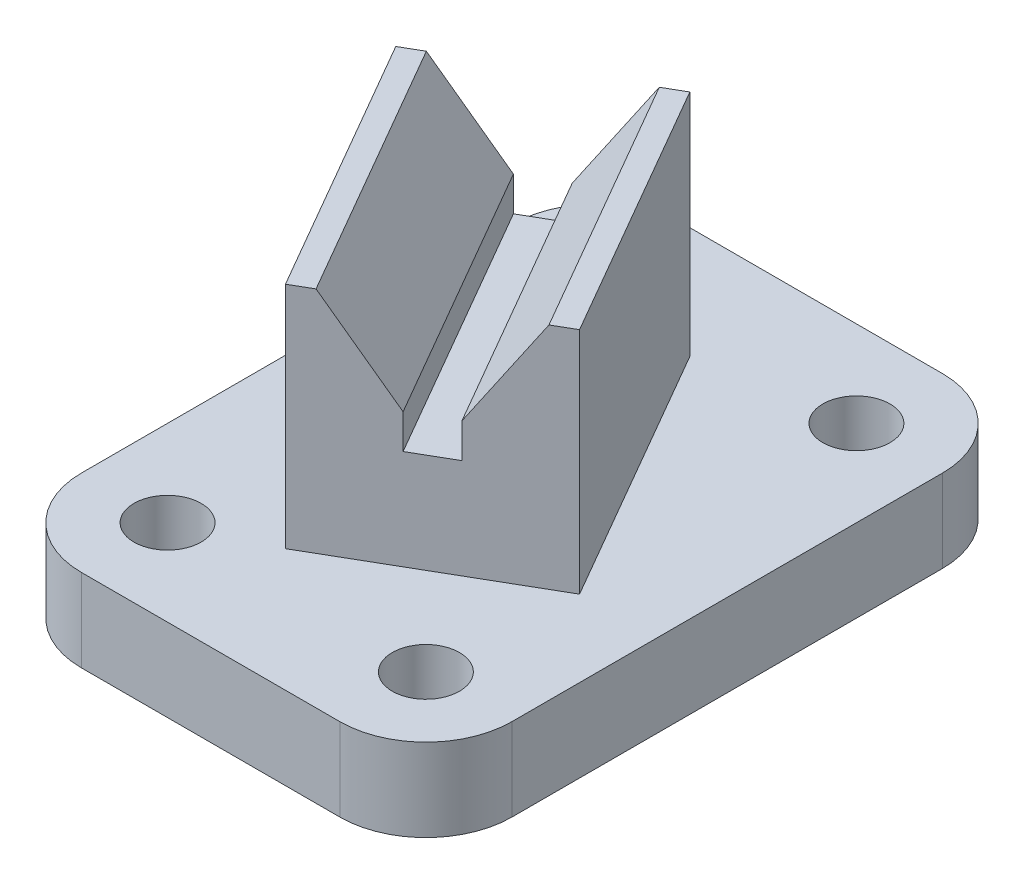
ISO-10303-21;
HEADER;
FILE_DESCRIPTION(('STEP AP214'),'2;1');
FILE_NAME('part.step','',(''),(''),'','','');
FILE_SCHEMA(('AUTOMOTIVE_DESIGN { 1 0 10303 214 1 1 1 1 }'));
ENDSEC;
DATA;
#1=APPLICATION_CONTEXT('core data for automotive mechanical design processes');
#2=APPLICATION_PROTOCOL_DEFINITION('international standard','automotive_design',2000,#1);
#3=PRODUCT_CONTEXT('',#1,'mechanical');
#4=PRODUCT('Part','Part','',(#3));
#5=PRODUCT_RELATED_PRODUCT_CATEGORY('part','',(#4));
#6=PRODUCT_DEFINITION_FORMATION('','',#4);
#7=PRODUCT_DEFINITION_CONTEXT('part definition',#1,'design');
#8=PRODUCT_DEFINITION('design','',#6,#7);
#9=PRODUCT_DEFINITION_SHAPE('','',#8);
#10=(LENGTH_UNIT() NAMED_UNIT(*) SI_UNIT(.MILLI.,.METRE.));
#11=(NAMED_UNIT(*) PLANE_ANGLE_UNIT() SI_UNIT($,.RADIAN.));
#12=(NAMED_UNIT(*) SI_UNIT($,.STERADIAN.) SOLID_ANGLE_UNIT());
#13=UNCERTAINTY_MEASURE_WITH_UNIT(LENGTH_MEASURE(1.E-05),#10,'distance_accuracy_value','');
#14=(GEOMETRIC_REPRESENTATION_CONTEXT(3) GLOBAL_UNCERTAINTY_ASSIGNED_CONTEXT((#13)) GLOBAL_UNIT_ASSIGNED_CONTEXT((#10,
#11,#12)) REPRESENTATION_CONTEXT('',''));
#15=CARTESIAN_POINT('',(0.,0.,0.));
#16=DIRECTION('',(0.,0.,1.));
#17=DIRECTION('',(1.,0.,0.));
#18=AXIS2_PLACEMENT_3D('',#15,#16,#17);
#19=CARTESIAN_POINT('',(0.313335950369593,33.782,-25.3250771291599));
#20=DIRECTION('',(0.5,0.,0.866025403784439));
#21=DIRECTION('',(0.866025403784439,0.,-0.5));
#22=AXIS2_PLACEMENT_3D('',#19,#20,#21);
#23=PLANE('',#22);
#24=DIRECTION('',(-0.483395195346347,0.829722110200009,0.279088346158185));
#25=VECTOR('',#24,1.);
#26=CARTESIAN_POINT('',(-16.6475173331422,20.6068338643605,-15.5327239202386));
#27=LINE('',#26,#25);
#28=CARTESIAN_POINT('',(-16.184447991724,19.812,-15.8000771291599));
#29=VERTEX_POINT('',#28);
#30=CARTESIAN_POINT('',(-24.3233547364901,33.782,-11.1010771291599));
#31=VERTEX_POINT('',#30);
#32=EDGE_CURVE('E160',#29,#31,#27,.T.);
#33=ORIENTED_EDGE('',*,*,#32,.F.);
#34=DIRECTION('',(0.,1.,0.));
#35=VECTOR('',#34,1.);
#36=CARTESIAN_POINT('',(-16.184447991724,33.782,-15.8000771291599));
#37=LINE('',#36,#35);
#38=CARTESIAN_POINT('',(-16.184447991724,14.732,-15.8000771291599));
#39=VERTEX_POINT('',#38);
#40=EDGE_CURVE('E384',#39,#29,#37,.T.);
#41=ORIENTED_EDGE('',*,*,#40,.F.);
#42=DIRECTION('',(-0.866025403784439,0.,0.5));
#43=VECTOR('',#42,1.);
#44=CARTESIAN_POINT('',(0.313335950369593,14.732,-25.3250771291599));
#45=LINE('',#44,#43);
#46=CARTESIAN_POINT('',(-10.6851866776928,14.732,-18.9750771291599));
#47=VERTEX_POINT('',#46);
#48=EDGE_CURVE('E386',#47,#39,#45,.T.);
#49=ORIENTED_EDGE('',*,*,#48,.F.);
#50=DIRECTION('',(0.,-1.,0.));
#51=VECTOR('',#50,1.);
#52=CARTESIAN_POINT('',(-10.6851866776928,33.782,-18.9750771291599));
#53=LINE('',#52,#51);
#54=CARTESIAN_POINT('',(-10.6851866776928,19.812,-18.9750771291599));
#55=VERTEX_POINT('',#54);
#56=EDGE_CURVE('E370',#55,#47,#53,.T.);
#57=ORIENTED_EDGE('',*,*,#56,.F.);
#58=DIRECTION('',(-0.483395195346347,-0.829722110200009,0.279088346158185));
#59=VECTOR('',#58,1.);
#60=CARTESIAN_POINT('',(-1.65533452003802,35.3112603550296,-24.1884647031244));
#61=LINE('',#60,#59);
#62=CARTESIAN_POINT('',(-2.54627993292662,33.782,-23.6740771291599));
#63=VERTEX_POINT('',#62);
#64=EDGE_CURVE('E173',#63,#55,#61,.T.);
#65=ORIENTED_EDGE('',*,*,#64,.F.);
#66=DIRECTION('',(-0.866025403784439,0.,0.5));
#67=VECTOR('',#66,1.);
#68=CARTESIAN_POINT('',(0.313335950369593,33.782,-25.3250771291599));
#69=LINE('',#68,#67);
#70=CARTESIAN_POINT('',(0.313335950369593,33.782,-25.3250771291599));
#71=VERTEX_POINT('',#70);
#72=EDGE_CURVE('E368',#71,#63,#69,.T.);
#73=ORIENTED_EDGE('',*,*,#72,.F.);
#74=DIRECTION('',(0.,-1.,0.));
#75=VECTOR('',#74,1.);
#76=CARTESIAN_POINT('',(0.313335950369593,33.782,-25.3250771291599));
#77=LINE('',#76,#75);
#78=CARTESIAN_POINT('',(0.313335950369593,0.,-25.3250771291599));
#79=VERTEX_POINT('',#78);
#80=EDGE_CURVE('E182',#71,#79,#77,.T.);
#81=ORIENTED_EDGE('',*,*,#80,.T.);
#82=DIRECTION('',(-0.866025403784439,0.,0.5));
#83=VECTOR('',#82,1.);
#84=CARTESIAN_POINT('',(0.313335950369593,0.,-25.3250771291599));
#85=LINE('',#84,#83);
#86=CARTESIAN_POINT('',(-27.1829706197863,0.,-9.45007712915988));
#87=VERTEX_POINT('',#86);
#88=EDGE_CURVE('E381',#79,#87,#85,.T.);
#89=ORIENTED_EDGE('',*,*,#88,.T.);
#90=DIRECTION('',(0.,-1.,0.));
#91=VECTOR('',#90,1.);
#92=CARTESIAN_POINT('',(-27.1829706197863,33.782,-9.45007712915988));
#93=LINE('',#92,#91);
#94=CARTESIAN_POINT('',(-27.1829706197863,33.782,-9.45007712915988));
#95=VERTEX_POINT('',#94);
#96=EDGE_CURVE('E192',#95,#87,#93,.T.);
#97=ORIENTED_EDGE('',*,*,#96,.F.);
#98=EDGE_CURVE('E373',#31,#95,#69,.T.);
#99=ORIENTED_EDGE('',*,*,#98,.F.);
#100=EDGE_LOOP('',(#33,#41,#49,#57,#65,#73,#81,#89,#97,#99));
#101=FACE_BOUND('',#100,.T.);
#102=ADVANCED_FACE('F27',(#101),#23,.F.);
#103=CARTESIAN_POINT('',(22.5383359503696,33.782,13.1697520690584));
#104=DIRECTION('',(-0.5,0.,-0.866025403784439));
#105=DIRECTION('',(-0.866025403784439,0.,0.5));
#106=AXIS2_PLACEMENT_3D('',#103,#104,#105);
#107=PLANE('',#106);
#108=DIRECTION('',(0.483395195346347,-0.829722110200009,-0.279088346158185));
#109=VECTOR('',#108,1.);
#110=CARTESIAN_POINT('',(-2.09835473649011,33.782,27.3937520690584));
#111=LINE('',#110,#109);
#112=CARTESIAN_POINT('',(-2.09835473649011,33.782,27.3937520690584));
#113=VERTEX_POINT('',#112);
#114=CARTESIAN_POINT('',(6.04055200827605,19.812,22.6947520690584));
#115=VERTEX_POINT('',#114);
#116=EDGE_CURVE('E157',#113,#115,#111,.T.);
#117=ORIENTED_EDGE('',*,*,#116,.F.);
#118=DIRECTION('',(0.866025403784439,0.,-0.5));
#119=VECTOR('',#118,1.);
#120=CARTESIAN_POINT('',(22.5383359503696,33.782,13.1697520690584));
#121=LINE('',#120,#119);
#122=CARTESIAN_POINT('',(-4.95797061978632,33.782,29.0447520690584));
#123=VERTEX_POINT('',#122);
#124=EDGE_CURVE('E170',#123,#113,#121,.T.);
#125=ORIENTED_EDGE('',*,*,#124,.F.);
#126=DIRECTION('',(0.,-1.,0.));
#127=VECTOR('',#126,1.);
#128=CARTESIAN_POINT('',(-4.95797061978632,33.782,29.0447520690584));
#129=LINE('',#128,#127);
#130=CARTESIAN_POINT('',(-4.95797061978632,0.,29.0447520690584));
#131=VERTEX_POINT('',#130);
#132=EDGE_CURVE('E190',#123,#131,#129,.T.);
#133=ORIENTED_EDGE('',*,*,#132,.T.);
#134=DIRECTION('',(0.866025403784439,0.,-0.5));
#135=VECTOR('',#134,1.);
#136=CARTESIAN_POINT('',(22.5383359503696,0.,13.1697520690584));
#137=LINE('',#136,#135);
#138=CARTESIAN_POINT('',(22.5383359503696,0.,13.1697520690584));
#139=VERTEX_POINT('',#138);
#140=EDGE_CURVE('E377',#131,#139,#137,.T.);
#141=ORIENTED_EDGE('',*,*,#140,.T.);
#142=DIRECTION('',(0.,-1.,0.));
#143=VECTOR('',#142,1.);
#144=CARTESIAN_POINT('',(22.5383359503696,33.782,13.1697520690584));
#145=LINE('',#144,#143);
#146=CARTESIAN_POINT('',(22.5383359503696,33.782,13.1697520690584));
#147=VERTEX_POINT('',#146);
#148=EDGE_CURVE('E50',#147,#139,#145,.T.);
#149=ORIENTED_EDGE('',*,*,#148,.F.);
#150=CARTESIAN_POINT('',(19.6787200670734,33.782,14.8207520690584));
#151=VERTEX_POINT('',#150);
#152=EDGE_CURVE('E180',#151,#147,#121,.T.);
#153=ORIENTED_EDGE('',*,*,#152,.F.);
#154=DIRECTION('',(0.483395195346347,0.829722110200009,-0.279088346158185));
#155=VECTOR('',#154,1.);
#156=CARTESIAN_POINT('',(11.5398133223072,19.812,19.5197520690584));
#157=LINE('',#156,#155);
#158=CARTESIAN_POINT('',(11.5398133223072,19.812,19.5197520690584));
#159=VERTEX_POINT('',#158);
#160=EDGE_CURVE('E42',#159,#151,#157,.T.);
#161=ORIENTED_EDGE('',*,*,#160,.F.);
#162=DIRECTION('',(0.,1.,0.));
#163=VECTOR('',#162,1.);
#164=CARTESIAN_POINT('',(11.5398133223072,14.732,19.5197520690584));
#165=LINE('',#164,#163);
#166=CARTESIAN_POINT('',(11.5398133223072,14.732,19.5197520690584));
#167=VERTEX_POINT('',#166);
#168=EDGE_CURVE('E396',#167,#159,#165,.T.);
#169=ORIENTED_EDGE('',*,*,#168,.F.);
#170=DIRECTION('',(0.866025403784438,0.,-0.500000000000001));
#171=VECTOR('',#170,1.);
#172=CARTESIAN_POINT('',(6.04055200827605,14.732,22.6947520690584));
#173=LINE('',#172,#171);
#174=CARTESIAN_POINT('',(6.04055200827605,14.732,22.6947520690584));
#175=VERTEX_POINT('',#174);
#176=EDGE_CURVE('E392',#175,#167,#173,.T.);
#177=ORIENTED_EDGE('',*,*,#176,.F.);
#178=DIRECTION('',(0.,-1.,0.));
#179=VECTOR('',#178,1.);
#180=CARTESIAN_POINT('',(6.04055200827605,19.812,22.6947520690584));
#181=LINE('',#180,#179);
#182=EDGE_CURVE('E164',#115,#175,#181,.T.);
#183=ORIENTED_EDGE('',*,*,#182,.F.);
#184=EDGE_LOOP('',(#117,#125,#133,#141,#149,#153,#161,#169,#177,#183));
#185=FACE_BOUND('',#184,.T.);
#186=ADVANCED_FACE('F168',(#185),#107,.F.);
#187=CARTESIAN_POINT('',(-27.1829706197863,33.782,-9.45007712915989));
#188=DIRECTION('',(0.,1.,0.));
#189=DIRECTION('',(0.,0.,1.));
#190=AXIS2_PLACEMENT_3D('',#187,#188,#189);
#191=PLANE('',#190);
#192=ORIENTED_EDGE('',*,*,#124,.T.);
#193=DIRECTION('',(-0.5,0.,-0.866025403784438));
#194=VECTOR('',#193,1.);
#195=CARTESIAN_POINT('',(-2.09835473649011,33.782,27.3937520690584));
#196=LINE('',#195,#194);
#197=EDGE_CURVE('E153',#113,#31,#196,.T.);
#198=ORIENTED_EDGE('',*,*,#197,.T.);
#199=ORIENTED_EDGE('',*,*,#98,.T.);
#200=DIRECTION('',(0.5,0.,0.866025403784439));
#201=VECTOR('',#200,1.);
#202=CARTESIAN_POINT('',(-27.1829706197863,33.782,-9.45007712915988));
#203=LINE('',#202,#201);
#204=EDGE_CURVE('E177',#95,#123,#203,.T.);
#205=ORIENTED_EDGE('',*,*,#204,.T.);
#206=EDGE_LOOP('',(#192,#198,#199,#205));
#207=FACE_BOUND('',#206,.T.);
#208=ADVANCED_FACE('F175',(#207),#191,.T.);
#209=ORIENTED_EDGE('',*,*,#72,.T.);
#210=DIRECTION('',(-0.5,0.,-0.866025403784438));
#211=VECTOR('',#210,1.);
#212=CARTESIAN_POINT('',(19.6787200670734,33.782,14.8207520690584));
#213=LINE('',#212,#211);
#214=EDGE_CURVE('E358',#151,#63,#213,.T.);
#215=ORIENTED_EDGE('',*,*,#214,.F.);
#216=ORIENTED_EDGE('',*,*,#152,.T.);
#217=DIRECTION('',(-0.5,0.,-0.866025403784438));
#218=VECTOR('',#217,1.);
#219=CARTESIAN_POINT('',(0.313335950369593,33.782,-25.3250771291599));
#220=LINE('',#219,#218);
#221=EDGE_CURVE('E179',#147,#71,#220,.T.);
#222=ORIENTED_EDGE('',*,*,#221,.T.);
#223=EDGE_LOOP('',(#209,#215,#216,#222));
#224=FACE_BOUND('',#223,.T.);
#225=ADVANCED_FACE('F340',(#224),#191,.T.);
#226=CARTESIAN_POINT('',(-29.6649253731343,0.,-41.7725746268657));
#227=DIRECTION('',(0.,1.,0.));
#228=DIRECTION('',(0.,0.,1.));
#229=AXIS2_PLACEMENT_3D('',#226,#227,#228);
#230=PLANE('',#229);
#231=CARTESIAN_POINT('',(-16.9649253731343,0.,-29.0725746268657));
#232=DIRECTION('',(0.,1.,0.));
#233=DIRECTION('',(0.,0.,1.));
#234=AXIS2_PLACEMENT_3D('',#231,#232,#233);
#235=CIRCLE('',#234,4.95299999999999);
#236=CARTESIAN_POINT('',(-16.9649253731343,0.,-24.1195746268657));
#237=VERTEX_POINT('',#236);
#238=EDGE_CURVE('E239',#237,#237,#235,.T.);
#239=ORIENTED_EDGE('',*,*,#238,.F.);
#240=EDGE_LOOP('',(#239));
#241=FACE_BOUND('',#240,.T.);
#242=CARTESIAN_POINT('',(-16.9649253731343,0.,34.4274253731343));
#243=DIRECTION('',(0.,1.,0.));
#244=DIRECTION('',(0.,0.,1.));
#245=AXIS2_PLACEMENT_3D('',#242,#243,#244);
#246=CIRCLE('',#245,4.95299999999999);
#247=CARTESIAN_POINT('',(-16.9649253731343,0.,39.3804253731343));
#248=VERTEX_POINT('',#247);
#249=EDGE_CURVE('E233',#248,#248,#246,.T.);
#250=ORIENTED_EDGE('',*,*,#249,.F.);
#251=EDGE_LOOP('',(#250));
#252=FACE_BOUND('',#251,.T.);
#253=DIRECTION('',(-1.,0.,0.));
#254=VECTOR('',#253,1.);
#255=CARTESIAN_POINT('',(-29.6649253731343,0.,-41.7725746268657));
#256=LINE('',#255,#254);
#257=CARTESIAN_POINT('',(21.1350746268657,0.,-41.7725746268657));
#258=VERTEX_POINT('',#257);
#259=CARTESIAN_POINT('',(-16.9649253731343,0.,-41.7725746268657));
#260=VERTEX_POINT('',#259);
#261=EDGE_CURVE('E215',#258,#260,#256,.T.);
#262=ORIENTED_EDGE('',*,*,#261,.T.);
#263=CARTESIAN_POINT('',(-16.9649253731343,0.,-29.0725746268657));
#264=DIRECTION('',(0.,1.,0.));
#265=DIRECTION('',(0.,0.,1.));
#266=AXIS2_PLACEMENT_3D('',#263,#264,#265);
#267=CIRCLE('',#266,12.7);
#268=CARTESIAN_POINT('',(-29.6649253731343,0.,-29.0725746268657));
#269=VERTEX_POINT('',#268);
#270=EDGE_CURVE('E253',#260,#269,#267,.T.);
#271=ORIENTED_EDGE('',*,*,#270,.T.);
#272=DIRECTION('',(0.,0.,1.));
#273=VECTOR('',#272,1.);
#274=CARTESIAN_POINT('',(-29.6649253731343,0.,-41.7725746268657));
#275=LINE('',#274,#273);
#276=CARTESIAN_POINT('',(-29.6649253731343,0.,34.4274253731343));
#277=VERTEX_POINT('',#276);
#278=EDGE_CURVE('E206',#269,#277,#275,.T.);
#279=ORIENTED_EDGE('',*,*,#278,.T.);
#280=CARTESIAN_POINT('',(-16.9649253731343,0.,34.4274253731343));
#281=DIRECTION('',(0.,1.,0.));
#282=DIRECTION('',(0.,0.,1.));
#283=AXIS2_PLACEMENT_3D('',#280,#281,#282);
#284=CIRCLE('',#283,12.7);
#285=CARTESIAN_POINT('',(-16.9649253731343,0.,47.1274253731343));
#286=VERTEX_POINT('',#285);
#287=EDGE_CURVE('E251',#277,#286,#284,.T.);
#288=ORIENTED_EDGE('',*,*,#287,.T.);
#289=DIRECTION('',(1.,0.,0.));
#290=VECTOR('',#289,1.);
#291=CARTESIAN_POINT('',(-29.6649253731343,0.,47.1274253731343));
#292=LINE('',#291,#290);
#293=CARTESIAN_POINT('',(21.1350746268657,0.,47.1274253731343));
#294=VERTEX_POINT('',#293);
#295=EDGE_CURVE('E209',#286,#294,#292,.T.);
#296=ORIENTED_EDGE('',*,*,#295,.T.);
#297=CARTESIAN_POINT('',(21.1350746268657,0.,34.4274253731343));
#298=DIRECTION('',(0.,1.,0.));
#299=DIRECTION('',(0.,0.,1.));
#300=AXIS2_PLACEMENT_3D('',#297,#298,#299);
#301=CIRCLE('',#300,12.7);
#302=CARTESIAN_POINT('',(33.8350746268657,0.,34.4274253731343));
#303=VERTEX_POINT('',#302);
#304=EDGE_CURVE('E247',#294,#303,#301,.T.);
#305=ORIENTED_EDGE('',*,*,#304,.T.);
#306=DIRECTION('',(0.,0.,-1.));
#307=VECTOR('',#306,1.);
#308=CARTESIAN_POINT('',(33.8350746268657,0.,-41.7725746268657));
#309=LINE('',#308,#307);
#310=CARTESIAN_POINT('',(33.8350746268657,0.,-29.0725746268657));
#311=VERTEX_POINT('',#310);
#312=EDGE_CURVE('E212',#303,#311,#309,.T.);
#313=ORIENTED_EDGE('',*,*,#312,.T.);
#314=CARTESIAN_POINT('',(21.1350746268657,0.,-29.0725746268657));
#315=DIRECTION('',(0.,1.,0.));
#316=DIRECTION('',(0.,0.,1.));
#317=AXIS2_PLACEMENT_3D('',#314,#315,#316);
#318=CIRCLE('',#317,12.7);
#319=EDGE_CURVE('E249',#311,#258,#318,.T.);
#320=ORIENTED_EDGE('',*,*,#319,.T.);
#321=EDGE_LOOP('',(#262,#271,#279,#288,#296,#305,#313,#320));
#322=FACE_BOUND('',#321,.T.);
#323=CARTESIAN_POINT('',(21.1350746268657,0.,34.4274253731343));
#324=DIRECTION('',(0.,1.,0.));
#325=DIRECTION('',(0.,0.,1.));
#326=AXIS2_PLACEMENT_3D('',#323,#324,#325);
#327=CIRCLE('',#326,4.95299999999999);
#328=CARTESIAN_POINT('',(21.1350746268657,0.,39.3804253731343));
#329=VERTEX_POINT('',#328);
#330=EDGE_CURVE('E200',#329,#329,#327,.T.);
#331=ORIENTED_EDGE('',*,*,#330,.F.);
#332=EDGE_LOOP('',(#331));
#333=FACE_BOUND('',#332,.T.);
#334=CARTESIAN_POINT('',(21.1350746268657,0.,-29.0725746268657));
#335=DIRECTION('',(0.,1.,0.));
#336=DIRECTION('',(0.,0.,1.));
#337=AXIS2_PLACEMENT_3D('',#334,#335,#336);
#338=CIRCLE('',#337,4.95299999999999);
#339=CARTESIAN_POINT('',(21.1350746268657,0.,-24.1195746268657));
#340=VERTEX_POINT('',#339);
#341=EDGE_CURVE('E197',#340,#340,#338,.T.);
#342=ORIENTED_EDGE('',*,*,#341,.F.);
#343=EDGE_LOOP('',(#342));
#344=FACE_BOUND('',#343,.T.);
#345=DIRECTION('',(0.5,0.,0.866025403784439));
#346=VECTOR('',#345,1.);
#347=CARTESIAN_POINT('',(-27.1829706197863,0.,-9.45007712915988));
#348=LINE('',#347,#346);
#349=EDGE_CURVE('E379',#87,#131,#348,.T.);
#350=ORIENTED_EDGE('',*,*,#349,.F.);
#351=ORIENTED_EDGE('',*,*,#88,.F.);
#352=DIRECTION('',(-0.5,0.,-0.866025403784438));
#353=VECTOR('',#352,1.);
#354=CARTESIAN_POINT('',(0.313335950369593,0.,-25.3250771291599));
#355=LINE('',#354,#353);
#356=EDGE_CURVE('E374',#139,#79,#355,.T.);
#357=ORIENTED_EDGE('',*,*,#356,.F.);
#358=ORIENTED_EDGE('',*,*,#140,.F.);
#359=EDGE_LOOP('',(#350,#351,#357,#358));
#360=FACE_BOUND('',#359,.T.);
#361=ADVANCED_FACE('F294',(#241,#252,#322,#333,#344,#360),#230,.T.);
#362=CARTESIAN_POINT('',(-29.6649253731343,-12.192,-41.7725746268657));
#363=DIRECTION('',(-1.,0.,0.));
#364=DIRECTION('',(0.,0.,1.));
#365=AXIS2_PLACEMENT_3D('',#362,#363,#364);
#366=PLANE('',#365);
#367=ORIENTED_EDGE('',*,*,#278,.F.);
#368=DIRECTION('',(0.,1.,0.));
#369=VECTOR('',#368,1.);
#370=CARTESIAN_POINT('',(-29.6649253731343,-12.192,-29.0725746268657));
#371=LINE('',#370,#369);
#372=CARTESIAN_POINT('',(-29.6649253731343,-12.192,-29.0725746268657));
#373=VERTEX_POINT('',#372);
#374=EDGE_CURVE('E258',#269,#373,#371,.F.);
#375=ORIENTED_EDGE('',*,*,#374,.T.);
#376=DIRECTION('',(0.,0.,1.));
#377=VECTOR('',#376,1.);
#378=CARTESIAN_POINT('',(-29.6649253731343,-12.192,-41.7725746268657));
#379=LINE('',#378,#377);
#380=CARTESIAN_POINT('',(-29.6649253731343,-12.192,34.4274253731343));
#381=VERTEX_POINT('',#380);
#382=EDGE_CURVE('E218',#373,#381,#379,.T.);
#383=ORIENTED_EDGE('',*,*,#382,.T.);
#384=DIRECTION('',(0.,1.,0.));
#385=VECTOR('',#384,1.);
#386=CARTESIAN_POINT('',(-29.6649253731343,-12.192,34.4274253731343));
#387=LINE('',#386,#385);
#388=EDGE_CURVE('E255',#381,#277,#387,.T.);
#389=ORIENTED_EDGE('',*,*,#388,.T.);
#390=EDGE_LOOP('',(#367,#375,#383,#389));
#391=FACE_BOUND('',#390,.T.);
#392=ADVANCED_FACE('F302',(#391),#366,.T.);
#393=CARTESIAN_POINT('',(-29.6649253731343,-12.192,-41.7725746268657));
#394=DIRECTION('',(0.,0.,-1.));
#395=DIRECTION('',(-1.,0.,0.));
#396=AXIS2_PLACEMENT_3D('',#393,#394,#395);
#397=PLANE('',#396);
#398=DIRECTION('',(-1.,0.,0.));
#399=VECTOR('',#398,1.);
#400=CARTESIAN_POINT('',(-29.6649253731343,-12.192,-41.7725746268657));
#401=LINE('',#400,#399);
#402=CARTESIAN_POINT('',(21.1350746268657,-12.192,-41.7725746268657));
#403=VERTEX_POINT('',#402);
#404=CARTESIAN_POINT('',(-16.9649253731343,-12.192,-41.7725746268657));
#405=VERTEX_POINT('',#404);
#406=EDGE_CURVE('E227',#403,#405,#401,.T.);
#407=ORIENTED_EDGE('',*,*,#406,.T.);
#408=DIRECTION('',(0.,1.,0.));
#409=VECTOR('',#408,1.);
#410=CARTESIAN_POINT('',(-16.9649253731343,-12.192,-41.7725746268657));
#411=LINE('',#410,#409);
#412=EDGE_CURVE('E244',#405,#260,#411,.T.);
#413=ORIENTED_EDGE('',*,*,#412,.T.);
#414=ORIENTED_EDGE('',*,*,#261,.F.);
#415=DIRECTION('',(0.,1.,0.));
#416=VECTOR('',#415,1.);
#417=CARTESIAN_POINT('',(21.1350746268657,-12.192,-41.7725746268657));
#418=LINE('',#417,#416);
#419=EDGE_CURVE('E242',#258,#403,#418,.F.);
#420=ORIENTED_EDGE('',*,*,#419,.T.);
#421=EDGE_LOOP('',(#407,#413,#414,#420));
#422=FACE_BOUND('',#421,.T.);
#423=ADVANCED_FACE('F310',(#422),#397,.T.);
#424=CARTESIAN_POINT('',(33.8350746268657,-12.192,-41.7725746268657));
#425=DIRECTION('',(1.,0.,0.));
#426=DIRECTION('',(0.,0.,-1.));
#427=AXIS2_PLACEMENT_3D('',#424,#425,#426);
#428=PLANE('',#427);
#429=DIRECTION('',(0.,0.,-1.));
#430=VECTOR('',#429,1.);
#431=CARTESIAN_POINT('',(33.8350746268657,-12.192,-41.7725746268657));
#432=LINE('',#431,#430);
#433=CARTESIAN_POINT('',(33.8350746268657,-12.192,34.4274253731343));
#434=VERTEX_POINT('',#433);
#435=CARTESIAN_POINT('',(33.8350746268657,-12.192,-29.0725746268657));
#436=VERTEX_POINT('',#435);
#437=EDGE_CURVE('E224',#434,#436,#432,.T.);
#438=ORIENTED_EDGE('',*,*,#437,.T.);
#439=DIRECTION('',(0.,1.,0.));
#440=VECTOR('',#439,1.);
#441=CARTESIAN_POINT('',(33.8350746268657,-12.192,-29.0725746268657));
#442=LINE('',#441,#440);
#443=EDGE_CURVE('E11',#436,#311,#442,.T.);
#444=ORIENTED_EDGE('',*,*,#443,.T.);
#445=ORIENTED_EDGE('',*,*,#312,.F.);
#446=DIRECTION('',(0.,1.,0.));
#447=VECTOR('',#446,1.);
#448=CARTESIAN_POINT('',(33.8350746268657,-12.192,34.4274253731343));
#449=LINE('',#448,#447);
#450=EDGE_CURVE('E35',#303,#434,#449,.F.);
#451=ORIENTED_EDGE('',*,*,#450,.T.);
#452=EDGE_LOOP('',(#438,#444,#445,#451));
#453=FACE_BOUND('',#452,.T.);
#454=ADVANCED_FACE('F276',(#453),#428,.T.);
#455=CARTESIAN_POINT('',(-29.6649253731343,-12.192,47.1274253731343));
#456=DIRECTION('',(0.,0.,1.));
#457=DIRECTION('',(1.,0.,0.));
#458=AXIS2_PLACEMENT_3D('',#455,#456,#457);
#459=PLANE('',#458);
#460=ORIENTED_EDGE('',*,*,#295,.F.);
#461=DIRECTION('',(0.,1.,0.));
#462=VECTOR('',#461,1.);
#463=CARTESIAN_POINT('',(-16.9649253731343,-12.192,47.1274253731343));
#464=LINE('',#463,#462);
#465=CARTESIAN_POINT('',(-16.9649253731343,-12.192,47.1274253731343));
#466=VERTEX_POINT('',#465);
#467=EDGE_CURVE('E271',#286,#466,#464,.F.);
#468=ORIENTED_EDGE('',*,*,#467,.T.);
#469=DIRECTION('',(1.,0.,0.));
#470=VECTOR('',#469,1.);
#471=CARTESIAN_POINT('',(-29.6649253731343,-12.192,47.1274253731343));
#472=LINE('',#471,#470);
#473=CARTESIAN_POINT('',(21.1350746268657,-12.192,47.1274253731343));
#474=VERTEX_POINT('',#473);
#475=EDGE_CURVE('E221',#466,#474,#472,.T.);
#476=ORIENTED_EDGE('',*,*,#475,.T.);
#477=DIRECTION('',(0.,1.,0.));
#478=VECTOR('',#477,1.);
#479=CARTESIAN_POINT('',(21.1350746268657,-12.192,47.1274253731343));
#480=LINE('',#479,#478);
#481=EDGE_CURVE('E268',#474,#294,#480,.T.);
#482=ORIENTED_EDGE('',*,*,#481,.T.);
#483=EDGE_LOOP('',(#460,#468,#476,#482));
#484=FACE_BOUND('',#483,.T.);
#485=ADVANCED_FACE('F291',(#484),#459,.T.);
#486=CARTESIAN_POINT('',(-29.6649253731343,-12.192,-41.7725746268657));
#487=DIRECTION('',(0.,1.,0.));
#488=DIRECTION('',(0.,0.,1.));
#489=AXIS2_PLACEMENT_3D('',#486,#487,#488);
#490=PLANE('',#489);
#491=CARTESIAN_POINT('',(21.1350746268657,-12.192,-29.0725746268657));
#492=DIRECTION('',(0.,1.,0.));
#493=DIRECTION('',(0.,0.,1.));
#494=AXIS2_PLACEMENT_3D('',#491,#492,#493);
#495=CIRCLE('',#494,4.95299999999999);
#496=CARTESIAN_POINT('',(21.1350746268657,-12.192,-24.1195746268657));
#497=VERTEX_POINT('',#496);
#498=EDGE_CURVE('E194',#497,#497,#495,.T.);
#499=ORIENTED_EDGE('',*,*,#498,.T.);
#500=EDGE_LOOP('',(#499));
#501=FACE_BOUND('',#500,.T.);
#502=CARTESIAN_POINT('',(21.1350746268657,-12.192,34.4274253731343));
#503=DIRECTION('',(0.,1.,0.));
#504=DIRECTION('',(0.,0.,1.));
#505=AXIS2_PLACEMENT_3D('',#502,#503,#504);
#506=CIRCLE('',#505,4.95299999999999);
#507=CARTESIAN_POINT('',(21.1350746268657,-12.192,39.3804253731343));
#508=VERTEX_POINT('',#507);
#509=EDGE_CURVE('E203',#508,#508,#506,.T.);
#510=ORIENTED_EDGE('',*,*,#509,.T.);
#511=EDGE_LOOP('',(#510));
#512=FACE_BOUND('',#511,.T.);
#513=ORIENTED_EDGE('',*,*,#382,.F.);
#514=CARTESIAN_POINT('',(-16.9649253731343,-12.192,-29.0725746268657));
#515=DIRECTION('',(0.,1.,0.));
#516=DIRECTION('',(0.,0.,1.));
#517=AXIS2_PLACEMENT_3D('',#514,#515,#516);
#518=CIRCLE('',#517,12.7);
#519=EDGE_CURVE('E266',#373,#405,#518,.F.);
#520=ORIENTED_EDGE('',*,*,#519,.T.);
#521=ORIENTED_EDGE('',*,*,#406,.F.);
#522=CARTESIAN_POINT('',(21.1350746268657,-12.192,-29.0725746268657));
#523=DIRECTION('',(0.,1.,0.));
#524=DIRECTION('',(0.,0.,1.));
#525=AXIS2_PLACEMENT_3D('',#522,#523,#524);
#526=CIRCLE('',#525,12.7);
#527=EDGE_CURVE('E262',#403,#436,#526,.F.);
#528=ORIENTED_EDGE('',*,*,#527,.T.);
#529=ORIENTED_EDGE('',*,*,#437,.F.);
#530=CARTESIAN_POINT('',(21.1350746268657,-12.192,34.4274253731343));
#531=DIRECTION('',(0.,1.,0.));
#532=DIRECTION('',(0.,0.,1.));
#533=AXIS2_PLACEMENT_3D('',#530,#531,#532);
#534=CIRCLE('',#533,12.7);
#535=EDGE_CURVE('E260',#434,#474,#534,.F.);
#536=ORIENTED_EDGE('',*,*,#535,.T.);
#537=ORIENTED_EDGE('',*,*,#475,.F.);
#538=CARTESIAN_POINT('',(-16.9649253731343,-12.192,34.4274253731343));
#539=DIRECTION('',(0.,1.,0.));
#540=DIRECTION('',(0.,0.,1.));
#541=AXIS2_PLACEMENT_3D('',#538,#539,#540);
#542=CIRCLE('',#541,12.7);
#543=EDGE_CURVE('E264',#466,#381,#542,.F.);
#544=ORIENTED_EDGE('',*,*,#543,.T.);
#545=EDGE_LOOP('',(#513,#520,#521,#528,#529,#536,#537,#544));
#546=FACE_BOUND('',#545,.T.);
#547=CARTESIAN_POINT('',(-16.9649253731343,-12.192,34.4274253731343));
#548=DIRECTION('',(0.,1.,0.));
#549=DIRECTION('',(0.,0.,1.));
#550=AXIS2_PLACEMENT_3D('',#547,#548,#549);
#551=CIRCLE('',#550,4.95299999999999);
#552=CARTESIAN_POINT('',(-16.9649253731343,-12.192,39.3804253731343));
#553=VERTEX_POINT('',#552);
#554=EDGE_CURVE('E230',#553,#553,#551,.T.);
#555=ORIENTED_EDGE('',*,*,#554,.T.);
#556=EDGE_LOOP('',(#555));
#557=FACE_BOUND('',#556,.T.);
#558=CARTESIAN_POINT('',(-16.9649253731343,-12.192,-29.0725746268657));
#559=DIRECTION('',(0.,1.,0.));
#560=DIRECTION('',(0.,0.,1.));
#561=AXIS2_PLACEMENT_3D('',#558,#559,#560);
#562=CIRCLE('',#561,4.95299999999999);
#563=CARTESIAN_POINT('',(-16.9649253731343,-12.192,-24.1195746268657));
#564=VERTEX_POINT('',#563);
#565=EDGE_CURVE('E236',#564,#564,#562,.T.);
#566=ORIENTED_EDGE('',*,*,#565,.T.);
#567=EDGE_LOOP('',(#566));
#568=FACE_BOUND('',#567,.T.);
#569=ADVANCED_FACE('F282',(#501,#512,#546,#557,#568),#490,.F.);
#570=CARTESIAN_POINT('',(21.1350746268657,-12.192,34.4274253731343));
#571=DIRECTION('',(0.,1.,0.));
#572=DIRECTION('',(0.,0.,1.));
#573=AXIS2_PLACEMENT_3D('',#570,#571,#572);
#574=CYLINDRICAL_SURFACE('',#573,4.95299999999999);
#575=ORIENTED_EDGE('',*,*,#509,.F.);
#576=EDGE_LOOP('',(#575));
#577=FACE_BOUND('',#576,.T.);
#578=ORIENTED_EDGE('',*,*,#330,.T.);
#579=EDGE_LOOP('',(#578));
#580=FACE_BOUND('',#579,.T.);
#581=ADVANCED_FACE('F426',(#577,#580),#574,.F.);
#582=CARTESIAN_POINT('',(21.1350746268657,-12.192,-29.0725746268657));
#583=DIRECTION('',(0.,1.,0.));
#584=DIRECTION('',(0.,0.,1.));
#585=AXIS2_PLACEMENT_3D('',#582,#583,#584);
#586=CYLINDRICAL_SURFACE('',#585,4.95299999999999);
#587=ORIENTED_EDGE('',*,*,#498,.F.);
#588=EDGE_LOOP('',(#587));
#589=FACE_BOUND('',#588,.T.);
#590=ORIENTED_EDGE('',*,*,#341,.T.);
#591=EDGE_LOOP('',(#590));
#592=FACE_BOUND('',#591,.T.);
#593=ADVANCED_FACE('F438',(#589,#592),#586,.F.);
#594=CARTESIAN_POINT('',(-16.9649253731343,-12.192,34.4274253731343));
#595=DIRECTION('',(0.,1.,0.));
#596=DIRECTION('',(0.,0.,1.));
#597=AXIS2_PLACEMENT_3D('',#594,#595,#596);
#598=CYLINDRICAL_SURFACE('',#597,4.95299999999999);
#599=ORIENTED_EDGE('',*,*,#554,.F.);
#600=EDGE_LOOP('',(#599));
#601=FACE_BOUND('',#600,.T.);
#602=ORIENTED_EDGE('',*,*,#249,.T.);
#603=EDGE_LOOP('',(#602));
#604=FACE_BOUND('',#603,.T.);
#605=ADVANCED_FACE('F436',(#601,#604),#598,.F.);
#606=CARTESIAN_POINT('',(-16.9649253731343,-12.192,-29.0725746268657));
#607=DIRECTION('',(0.,1.,0.));
#608=DIRECTION('',(0.,0.,1.));
#609=AXIS2_PLACEMENT_3D('',#606,#607,#608);
#610=CYLINDRICAL_SURFACE('',#609,4.95299999999999);
#611=ORIENTED_EDGE('',*,*,#565,.F.);
#612=EDGE_LOOP('',(#611));
#613=FACE_BOUND('',#612,.T.);
#614=ORIENTED_EDGE('',*,*,#238,.T.);
#615=EDGE_LOOP('',(#614));
#616=FACE_BOUND('',#615,.T.);
#617=ADVANCED_FACE('F29',(#613,#616),#610,.F.);
#618=CARTESIAN_POINT('',(-16.9649253731343,-12.192,-29.0725746268657));
#619=DIRECTION('',(0.,1.,0.));
#620=DIRECTION('',(0.,0.,1.));
#621=AXIS2_PLACEMENT_3D('',#618,#619,#620);
#622=CYLINDRICAL_SURFACE('',#621,12.7);
#623=ORIENTED_EDGE('',*,*,#519,.F.);
#624=ORIENTED_EDGE('',*,*,#374,.F.);
#625=ORIENTED_EDGE('',*,*,#270,.F.);
#626=ORIENTED_EDGE('',*,*,#412,.F.);
#627=EDGE_LOOP('',(#623,#624,#625,#626));
#628=FACE_BOUND('',#627,.T.);
#629=ADVANCED_FACE('F307',(#628),#622,.T.);
#630=CARTESIAN_POINT('',(-16.9649253731343,-12.192,34.4274253731343));
#631=DIRECTION('',(0.,1.,0.));
#632=DIRECTION('',(0.,0.,1.));
#633=AXIS2_PLACEMENT_3D('',#630,#631,#632);
#634=CYLINDRICAL_SURFACE('',#633,12.7);
#635=ORIENTED_EDGE('',*,*,#543,.F.);
#636=ORIENTED_EDGE('',*,*,#467,.F.);
#637=ORIENTED_EDGE('',*,*,#287,.F.);
#638=ORIENTED_EDGE('',*,*,#388,.F.);
#639=EDGE_LOOP('',(#635,#636,#637,#638));
#640=FACE_BOUND('',#639,.T.);
#641=ADVANCED_FACE('F300',(#640),#634,.T.);
#642=CARTESIAN_POINT('',(21.1350746268657,-12.192,-29.0725746268657));
#643=DIRECTION('',(0.,1.,0.));
#644=DIRECTION('',(0.,0.,1.));
#645=AXIS2_PLACEMENT_3D('',#642,#643,#644);
#646=CYLINDRICAL_SURFACE('',#645,12.7);
#647=ORIENTED_EDGE('',*,*,#527,.F.);
#648=ORIENTED_EDGE('',*,*,#419,.F.);
#649=ORIENTED_EDGE('',*,*,#319,.F.);
#650=ORIENTED_EDGE('',*,*,#443,.F.);
#651=EDGE_LOOP('',(#647,#648,#649,#650));
#652=FACE_BOUND('',#651,.T.);
#653=ADVANCED_FACE('F313',(#652),#646,.T.);
#654=CARTESIAN_POINT('',(21.1350746268657,-12.192,34.4274253731343));
#655=DIRECTION('',(0.,1.,0.));
#656=DIRECTION('',(0.,0.,1.));
#657=AXIS2_PLACEMENT_3D('',#654,#655,#656);
#658=CYLINDRICAL_SURFACE('',#657,12.7);
#659=ORIENTED_EDGE('',*,*,#535,.F.);
#660=ORIENTED_EDGE('',*,*,#450,.F.);
#661=ORIENTED_EDGE('',*,*,#304,.F.);
#662=ORIENTED_EDGE('',*,*,#481,.F.);
#663=EDGE_LOOP('',(#659,#660,#661,#662));
#664=FACE_BOUND('',#663,.T.);
#665=ADVANCED_FACE('F288',(#664),#658,.T.);
#666=CARTESIAN_POINT('',(-27.1829706197863,33.782,-9.45007712915988));
#667=DIRECTION('',(0.866025403784439,0.,-0.5));
#668=DIRECTION('',(-0.5,0.,-0.866025403784439));
#669=AXIS2_PLACEMENT_3D('',#666,#667,#668);
#670=PLANE('',#669);
#671=ORIENTED_EDGE('',*,*,#349,.T.);
#672=ORIENTED_EDGE('',*,*,#132,.F.);
#673=ORIENTED_EDGE('',*,*,#204,.F.);
#674=ORIENTED_EDGE('',*,*,#96,.T.);
#675=EDGE_LOOP('',(#671,#672,#673,#674));
#676=FACE_BOUND('',#675,.T.);
#677=ADVANCED_FACE('F320',(#676),#670,.F.);
#678=CARTESIAN_POINT('',(0.313335950369593,33.782,-25.3250771291599));
#679=DIRECTION('',(-0.866025403784438,0.,0.5));
#680=DIRECTION('',(0.5,0.,0.866025403784439));
#681=AXIS2_PLACEMENT_3D('',#678,#679,#680);
#682=PLANE('',#681);
#683=ORIENTED_EDGE('',*,*,#356,.T.);
#684=ORIENTED_EDGE('',*,*,#80,.F.);
#685=ORIENTED_EDGE('',*,*,#221,.F.);
#686=ORIENTED_EDGE('',*,*,#148,.T.);
#687=EDGE_LOOP('',(#683,#684,#685,#686));
#688=FACE_BOUND('',#687,.T.);
#689=ADVANCED_FACE('F333',(#688),#682,.F.);
#690=CARTESIAN_POINT('',(6.04055200827605,19.812,22.6947520690584));
#691=DIRECTION('',(0.866025403784438,0.,-0.5));
#692=DIRECTION('',(-0.5,0.,-0.866025403784439));
#693=AXIS2_PLACEMENT_3D('',#690,#691,#692);
#694=PLANE('',#693);
#695=DIRECTION('',(-0.5,0.,-0.866025403784438));
#696=VECTOR('',#695,1.);
#697=CARTESIAN_POINT('',(6.04055200827605,14.732,22.6947520690584));
#698=LINE('',#697,#696);
#699=EDGE_CURVE('E393',#175,#39,#698,.T.);
#700=ORIENTED_EDGE('',*,*,#699,.T.);
#701=ORIENTED_EDGE('',*,*,#40,.T.);
#702=DIRECTION('',(-0.5,0.,-0.866025403784438));
#703=VECTOR('',#702,1.);
#704=CARTESIAN_POINT('',(6.04055200827605,19.812,22.6947520690584));
#705=LINE('',#704,#703);
#706=EDGE_CURVE('E390',#115,#29,#705,.T.);
#707=ORIENTED_EDGE('',*,*,#706,.F.);
#708=ORIENTED_EDGE('',*,*,#182,.T.);
#709=EDGE_LOOP('',(#700,#701,#707,#708));
#710=FACE_BOUND('',#709,.T.);
#711=ADVANCED_FACE('F337',(#710),#694,.T.);
#712=CARTESIAN_POINT('',(6.04055200827605,14.732,22.6947520690584));
#713=DIRECTION('',(0.,1.,0.));
#714=DIRECTION('',(0.,0.,1.));
#715=AXIS2_PLACEMENT_3D('',#712,#713,#714);
#716=PLANE('',#715);
#717=DIRECTION('',(-0.5,0.,-0.866025403784438));
#718=VECTOR('',#717,1.);
#719=CARTESIAN_POINT('',(11.5398133223072,14.732,19.5197520690584));
#720=LINE('',#719,#718);
#721=EDGE_CURVE('E364',#167,#47,#720,.T.);
#722=ORIENTED_EDGE('',*,*,#721,.T.);
#723=ORIENTED_EDGE('',*,*,#48,.T.);
#724=ORIENTED_EDGE('',*,*,#699,.F.);
#725=ORIENTED_EDGE('',*,*,#176,.T.);
#726=EDGE_LOOP('',(#722,#723,#724,#725));
#727=FACE_BOUND('',#726,.T.);
#728=ADVANCED_FACE('F347',(#727),#716,.T.);
#729=CARTESIAN_POINT('',(11.5398133223072,14.732,19.5197520690584));
#730=DIRECTION('',(-0.866025403784438,0.,0.5));
#731=DIRECTION('',(0.5,0.,0.866025403784439));
#732=AXIS2_PLACEMENT_3D('',#729,#730,#731);
#733=PLANE('',#732);
#734=DIRECTION('',(-0.5,0.,-0.866025403784438));
#735=VECTOR('',#734,1.);
#736=CARTESIAN_POINT('',(11.5398133223072,19.812,19.5197520690584));
#737=LINE('',#736,#735);
#738=EDGE_CURVE('E399',#159,#55,#737,.T.);
#739=ORIENTED_EDGE('',*,*,#738,.T.);
#740=ORIENTED_EDGE('',*,*,#56,.T.);
#741=ORIENTED_EDGE('',*,*,#721,.F.);
#742=ORIENTED_EDGE('',*,*,#168,.T.);
#743=EDGE_LOOP('',(#739,#740,#741,#742));
#744=FACE_BOUND('',#743,.T.);
#745=ADVANCED_FACE('F344',(#744),#733,.T.);
#746=CARTESIAN_POINT('',(-2.09835473649011,33.782,27.3937520690584));
#747=DIRECTION('',(0.718560425514839,0.55817669231637,-0.414861055100005));
#748=DIRECTION('',(-0.613458656803069,0.789726836566528,0.));
#749=AXIS2_PLACEMENT_3D('',#746,#747,#748);
#750=PLANE('',#749);
#751=ORIENTED_EDGE('',*,*,#706,.T.);
#752=ORIENTED_EDGE('',*,*,#32,.T.);
#753=ORIENTED_EDGE('',*,*,#197,.F.);
#754=ORIENTED_EDGE('',*,*,#116,.T.);
#755=EDGE_LOOP('',(#751,#752,#753,#754));
#756=FACE_BOUND('',#755,.T.);
#757=ADVANCED_FACE('F156',(#756),#750,.T.);
#758=CARTESIAN_POINT('',(11.5398133223072,19.812,19.5197520690584));
#759=DIRECTION('',(-0.71856042551484,0.55817669231637,0.414861055100005));
#760=DIRECTION('',(-0.613458656803069,-0.789726836566528,0.));
#761=AXIS2_PLACEMENT_3D('',#758,#759,#760);
#762=PLANE('',#761);
#763=ORIENTED_EDGE('',*,*,#214,.T.);
#764=ORIENTED_EDGE('',*,*,#64,.T.);
#765=ORIENTED_EDGE('',*,*,#738,.F.);
#766=ORIENTED_EDGE('',*,*,#160,.T.);
#767=EDGE_LOOP('',(#763,#764,#765,#766));
#768=FACE_BOUND('',#767,.T.);
#769=ADVANCED_FACE('F343',(#768),#762,.T.);
#770=CLOSED_SHELL('',(#102,#186,#208,#225,#361,#392,#423,#454,#485,#569,#581,#593,#605,#617,
#629,#641,#653,#665,#677,#689,#711,#728,#745,#757,#769));
#771=MANIFOLD_SOLID_BREP('B2',#770);
#772=ADVANCED_BREP_SHAPE_REPRESENTATION('',(#18,#771),#14);
#773=SHAPE_DEFINITION_REPRESENTATION(#9,#772);
ENDSEC;
END-ISO-10303-21;
